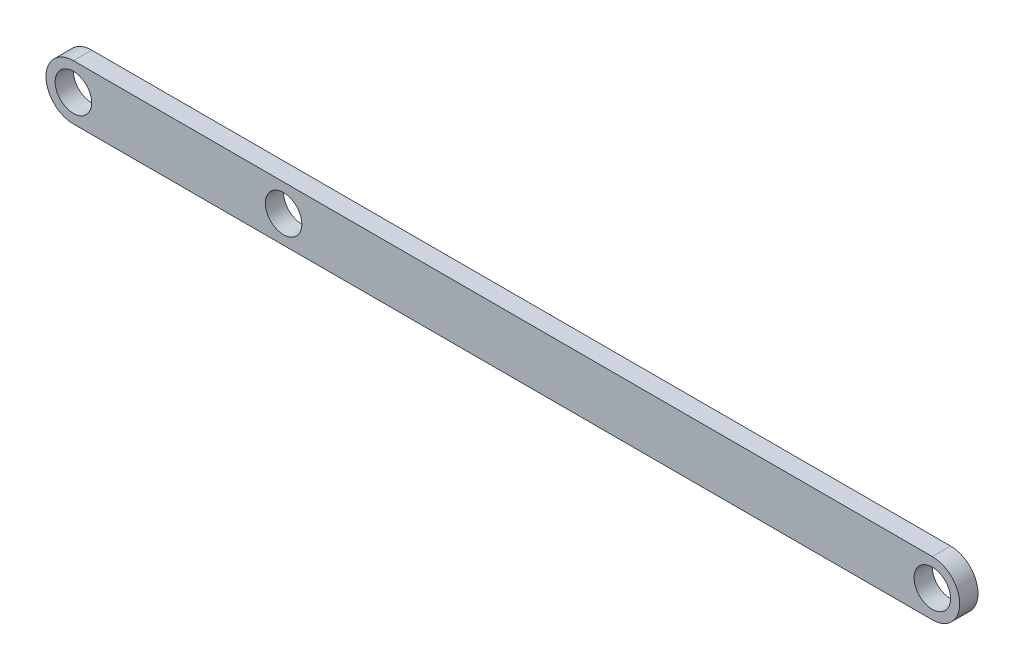
ISO-10303-21;
HEADER;
FILE_DESCRIPTION(('STEP AP214'),'2;1');
FILE_NAME('part.step','',(''),(''),'','','');
FILE_SCHEMA(('AUTOMOTIVE_DESIGN { 1 0 10303 214 1 1 1 1 }'));
ENDSEC;
DATA;
#1=APPLICATION_CONTEXT('core data for automotive mechanical design processes');
#2=APPLICATION_PROTOCOL_DEFINITION('international standard','automotive_design',2000,#1);
#3=PRODUCT_CONTEXT('',#1,'mechanical');
#4=PRODUCT('Part','Part','',(#3));
#5=PRODUCT_RELATED_PRODUCT_CATEGORY('part','',(#4));
#6=PRODUCT_DEFINITION_FORMATION('','',#4);
#7=PRODUCT_DEFINITION_CONTEXT('part definition',#1,'design');
#8=PRODUCT_DEFINITION('design','',#6,#7);
#9=PRODUCT_DEFINITION_SHAPE('','',#8);
#10=(LENGTH_UNIT() NAMED_UNIT(*) SI_UNIT(.MILLI.,.METRE.));
#11=(NAMED_UNIT(*) PLANE_ANGLE_UNIT() SI_UNIT($,.RADIAN.));
#12=(NAMED_UNIT(*) SI_UNIT($,.STERADIAN.) SOLID_ANGLE_UNIT());
#13=UNCERTAINTY_MEASURE_WITH_UNIT(LENGTH_MEASURE(1.E-05),#10,'distance_accuracy_value','');
#14=(GEOMETRIC_REPRESENTATION_CONTEXT(3) GLOBAL_UNCERTAINTY_ASSIGNED_CONTEXT((#13)) GLOBAL_UNIT_ASSIGNED_CONTEXT((#10,
#11,#12)) REPRESENTATION_CONTEXT('',''));
#15=CARTESIAN_POINT('',(0.,0.,0.));
#16=DIRECTION('',(0.,0.,1.));
#17=DIRECTION('',(1.,0.,0.));
#18=AXIS2_PLACEMENT_3D('',#15,#16,#17);
#19=CARTESIAN_POINT('',(0.,0.,5.));
#20=DIRECTION('',(0.,0.,-1.));
#21=DIRECTION('',(-1.,0.,0.));
#22=AXIS2_PLACEMENT_3D('',#19,#20,#21);
#23=PLANE('',#22);
#24=CARTESIAN_POINT('',(-185.,7.5,5.));
#25=DIRECTION('',(0.,0.,1.));
#26=DIRECTION('',(1.,0.,0.));
#27=AXIS2_PLACEMENT_3D('',#24,#25,#26);
#28=CIRCLE('',#27,4.99999999999999);
#29=CARTESIAN_POINT('',(-180.,7.5,5.));
#30=VERTEX_POINT('',#29);
#31=EDGE_CURVE('E174',#30,#30,#28,.T.);
#32=ORIENTED_EDGE('',*,*,#31,.F.);
#33=EDGE_LOOP('',(#32));
#34=FACE_BOUND('',#33,.T.);
#35=CARTESIAN_POINT('',(-242.5,7.5,5.));
#36=DIRECTION('',(0.,0.,1.));
#37=DIRECTION('',(1.,0.,0.));
#38=AXIS2_PLACEMENT_3D('',#35,#36,#37);
#39=CIRCLE('',#38,7.50000000000001);
#40=CARTESIAN_POINT('',(-242.5,15.,5.));
#41=VERTEX_POINT('',#40);
#42=CARTESIAN_POINT('',(-242.5,0.,5.));
#43=VERTEX_POINT('',#42);
#44=EDGE_CURVE('E107',#41,#43,#39,.T.);
#45=ORIENTED_EDGE('',*,*,#44,.T.);
#46=DIRECTION('',(1.,0.,0.));
#47=VECTOR('',#46,1.);
#48=CARTESIAN_POINT('',(-250.,0.,5.));
#49=LINE('',#48,#47);
#50=CARTESIAN_POINT('',(-7.50000000000001,0.,5.));
#51=VERTEX_POINT('',#50);
#52=EDGE_CURVE('E93',#43,#51,#49,.T.);
#53=ORIENTED_EDGE('',*,*,#52,.T.);
#54=CARTESIAN_POINT('',(-7.50000000000001,7.5,5.));
#55=DIRECTION('',(0.,0.,1.));
#56=DIRECTION('',(1.,0.,0.));
#57=AXIS2_PLACEMENT_3D('',#54,#55,#56);
#58=CIRCLE('',#57,7.50000000000001);
#59=CARTESIAN_POINT('',(-7.50000000000001,15.,5.));
#60=VERTEX_POINT('',#59);
#61=EDGE_CURVE('E133',#60,#51,#58,.F.);
#62=ORIENTED_EDGE('',*,*,#61,.F.);
#63=DIRECTION('',(-1.,0.,0.));
#64=VECTOR('',#63,1.);
#65=CARTESIAN_POINT('',(-250.,15.,5.));
#66=LINE('',#65,#64);
#67=EDGE_CURVE('E12',#60,#41,#66,.T.);
#68=ORIENTED_EDGE('',*,*,#67,.T.);
#69=EDGE_LOOP('',(#45,#53,#62,#68));
#70=FACE_BOUND('',#69,.T.);
#71=CARTESIAN_POINT('',(-7.50000000000001,7.5,5.));
#72=DIRECTION('',(0.,0.,1.));
#73=DIRECTION('',(1.,0.,0.));
#74=AXIS2_PLACEMENT_3D('',#71,#72,#73);
#75=CIRCLE('',#74,5.);
#76=CARTESIAN_POINT('',(-2.5,7.5,5.));
#77=VERTEX_POINT('',#76);
#78=EDGE_CURVE('E160',#77,#77,#75,.F.);
#79=ORIENTED_EDGE('',*,*,#78,.T.);
#80=EDGE_LOOP('',(#79));
#81=FACE_BOUND('',#80,.T.);
#82=CARTESIAN_POINT('',(-242.5,7.5,5.));
#83=DIRECTION('',(0.,0.,1.));
#84=DIRECTION('',(1.,0.,0.));
#85=AXIS2_PLACEMENT_3D('',#82,#83,#84);
#86=CIRCLE('',#85,4.99999999999999);
#87=CARTESIAN_POINT('',(-237.5,7.5,5.));
#88=VERTEX_POINT('',#87);
#89=EDGE_CURVE('E166',#88,#88,#86,.T.);
#90=ORIENTED_EDGE('',*,*,#89,.F.);
#91=EDGE_LOOP('',(#90));
#92=FACE_BOUND('',#91,.T.);
#93=ADVANCED_FACE('F84',(#34,#70,#81,#92),#23,.F.);
#94=CARTESIAN_POINT('',(0.,0.,0.));
#95=DIRECTION('',(0.,0.,-1.));
#96=DIRECTION('',(-1.,0.,0.));
#97=AXIS2_PLACEMENT_3D('',#94,#95,#96);
#98=PLANE('',#97);
#99=CARTESIAN_POINT('',(-185.,7.5,0.));
#100=DIRECTION('',(0.,0.,1.));
#101=DIRECTION('',(1.,0.,0.));
#102=AXIS2_PLACEMENT_3D('',#99,#100,#101);
#103=CIRCLE('',#102,4.99999999999999);
#104=CARTESIAN_POINT('',(-180.,7.5,0.));
#105=VERTEX_POINT('',#104);
#106=EDGE_CURVE('E147',#105,#105,#103,.T.);
#107=ORIENTED_EDGE('',*,*,#106,.T.);
#108=EDGE_LOOP('',(#107));
#109=FACE_BOUND('',#108,.T.);
#110=CARTESIAN_POINT('',(-7.50000000000001,7.5,0.));
#111=DIRECTION('',(0.,0.,1.));
#112=DIRECTION('',(1.,0.,0.));
#113=AXIS2_PLACEMENT_3D('',#110,#111,#112);
#114=CIRCLE('',#113,5.);
#115=CARTESIAN_POINT('',(-2.5,7.5,0.));
#116=VERTEX_POINT('',#115);
#117=EDGE_CURVE('E141',#116,#116,#114,.F.);
#118=ORIENTED_EDGE('',*,*,#117,.F.);
#119=EDGE_LOOP('',(#118));
#120=FACE_BOUND('',#119,.T.);
#121=DIRECTION('',(1.,0.,0.));
#122=VECTOR('',#121,1.);
#123=CARTESIAN_POINT('',(-250.,0.,0.));
#124=LINE('',#123,#122);
#125=CARTESIAN_POINT('',(-242.5,0.,0.));
#126=VERTEX_POINT('',#125);
#127=CARTESIAN_POINT('',(-7.50000000000001,0.,0.));
#128=VERTEX_POINT('',#127);
#129=EDGE_CURVE('E145',#126,#128,#124,.T.);
#130=ORIENTED_EDGE('',*,*,#129,.F.);
#131=CARTESIAN_POINT('',(-242.5,7.5,0.));
#132=DIRECTION('',(0.,0.,1.));
#133=DIRECTION('',(1.,0.,0.));
#134=AXIS2_PLACEMENT_3D('',#131,#132,#133);
#135=CIRCLE('',#134,7.50000000000001);
#136=CARTESIAN_POINT('',(-242.5,15.,0.));
#137=VERTEX_POINT('',#136);
#138=EDGE_CURVE('E123',#137,#126,#135,.T.);
#139=ORIENTED_EDGE('',*,*,#138,.F.);
#140=DIRECTION('',(-1.,0.,0.));
#141=VECTOR('',#140,1.);
#142=CARTESIAN_POINT('',(-250.,15.,0.));
#143=LINE('',#142,#141);
#144=CARTESIAN_POINT('',(-7.50000000000001,15.,0.));
#145=VERTEX_POINT('',#144);
#146=EDGE_CURVE('E88',#145,#137,#143,.T.);
#147=ORIENTED_EDGE('',*,*,#146,.F.);
#148=CARTESIAN_POINT('',(-7.50000000000001,7.5,0.));
#149=DIRECTION('',(0.,0.,1.));
#150=DIRECTION('',(1.,0.,0.));
#151=AXIS2_PLACEMENT_3D('',#148,#149,#150);
#152=CIRCLE('',#151,7.50000000000001);
#153=EDGE_CURVE('E131',#145,#128,#152,.F.);
#154=ORIENTED_EDGE('',*,*,#153,.T.);
#155=EDGE_LOOP('',(#130,#139,#147,#154));
#156=FACE_BOUND('',#155,.T.);
#157=CARTESIAN_POINT('',(-242.5,7.5,0.));
#158=DIRECTION('',(0.,0.,1.));
#159=DIRECTION('',(1.,0.,0.));
#160=AXIS2_PLACEMENT_3D('',#157,#158,#159);
#161=CIRCLE('',#160,4.99999999999999);
#162=CARTESIAN_POINT('',(-237.5,7.5,0.));
#163=VERTEX_POINT('',#162);
#164=EDGE_CURVE('E163',#163,#163,#161,.T.);
#165=ORIENTED_EDGE('',*,*,#164,.T.);
#166=EDGE_LOOP('',(#165));
#167=FACE_BOUND('',#166,.T.);
#168=ADVANCED_FACE('F180',(#109,#120,#156,#167),#98,.T.);
#169=CARTESIAN_POINT('',(-250.,0.,5.));
#170=DIRECTION('',(0.,1.,0.));
#171=DIRECTION('',(0.,0.,1.));
#172=AXIS2_PLACEMENT_3D('',#169,#170,#171);
#173=PLANE('',#172);
#174=DIRECTION('',(0.,0.,1.));
#175=VECTOR('',#174,1.);
#176=CARTESIAN_POINT('',(-242.5,0.,0.));
#177=LINE('',#176,#175);
#178=EDGE_CURVE('E146',#126,#43,#177,.T.);
#179=ORIENTED_EDGE('',*,*,#178,.F.);
#180=ORIENTED_EDGE('',*,*,#129,.T.);
#181=DIRECTION('',(0.,0.,1.));
#182=VECTOR('',#181,1.);
#183=CARTESIAN_POINT('',(-7.50000000000001,0.,0.));
#184=LINE('',#183,#182);
#185=EDGE_CURVE('E136',#128,#51,#184,.T.);
#186=ORIENTED_EDGE('',*,*,#185,.T.);
#187=ORIENTED_EDGE('',*,*,#52,.F.);
#188=EDGE_LOOP('',(#179,#180,#186,#187));
#189=FACE_BOUND('',#188,.T.);
#190=ADVANCED_FACE('F86',(#189),#173,.F.);
#191=CARTESIAN_POINT('',(-250.,15.,5.));
#192=DIRECTION('',(0.,-1.,0.));
#193=DIRECTION('',(1.,0.,0.));
#194=AXIS2_PLACEMENT_3D('',#191,#192,#193);
#195=PLANE('',#194);
#196=ORIENTED_EDGE('',*,*,#146,.T.);
#197=DIRECTION('',(0.,0.,1.));
#198=VECTOR('',#197,1.);
#199=CARTESIAN_POINT('',(-242.5,15.,0.));
#200=LINE('',#199,#198);
#201=EDGE_CURVE('E101',#137,#41,#200,.T.);
#202=ORIENTED_EDGE('',*,*,#201,.T.);
#203=ORIENTED_EDGE('',*,*,#67,.F.);
#204=DIRECTION('',(0.,0.,1.));
#205=VECTOR('',#204,1.);
#206=CARTESIAN_POINT('',(-7.50000000000001,15.,0.));
#207=LINE('',#206,#205);
#208=EDGE_CURVE('E119',#145,#60,#207,.T.);
#209=ORIENTED_EDGE('',*,*,#208,.F.);
#210=EDGE_LOOP('',(#196,#202,#203,#209));
#211=FACE_BOUND('',#210,.T.);
#212=ADVANCED_FACE('F198',(#211),#195,.F.);
#213=CARTESIAN_POINT('',(-7.50000000000001,7.5,0.));
#214=DIRECTION('',(0.,0.,1.));
#215=DIRECTION('',(1.,0.,0.));
#216=AXIS2_PLACEMENT_3D('',#213,#214,#215);
#217=CYLINDRICAL_SURFACE('',#216,7.50000000000001);
#218=ORIENTED_EDGE('',*,*,#61,.T.);
#219=ORIENTED_EDGE('',*,*,#185,.F.);
#220=ORIENTED_EDGE('',*,*,#153,.F.);
#221=ORIENTED_EDGE('',*,*,#208,.T.);
#222=EDGE_LOOP('',(#218,#219,#220,#221));
#223=FACE_BOUND('',#222,.T.);
#224=ADVANCED_FACE('F135',(#223),#217,.T.);
#225=CARTESIAN_POINT('',(-7.50000000000001,7.5,0.));
#226=DIRECTION('',(0.,0.,1.));
#227=DIRECTION('',(1.,0.,0.));
#228=AXIS2_PLACEMENT_3D('',#225,#226,#227);
#229=CYLINDRICAL_SURFACE('',#228,5.);
#230=ORIENTED_EDGE('',*,*,#117,.T.);
#231=EDGE_LOOP('',(#230));
#232=FACE_BOUND('',#231,.T.);
#233=ORIENTED_EDGE('',*,*,#78,.F.);
#234=EDGE_LOOP('',(#233));
#235=FACE_BOUND('',#234,.T.);
#236=ADVANCED_FACE('F204',(#232,#235),#229,.F.);
#237=CARTESIAN_POINT('',(-242.5,7.5,0.));
#238=DIRECTION('',(0.,0.,1.));
#239=DIRECTION('',(1.,0.,0.));
#240=AXIS2_PLACEMENT_3D('',#237,#238,#239);
#241=CYLINDRICAL_SURFACE('',#240,7.50000000000001);
#242=ORIENTED_EDGE('',*,*,#44,.F.);
#243=ORIENTED_EDGE('',*,*,#201,.F.);
#244=ORIENTED_EDGE('',*,*,#138,.T.);
#245=ORIENTED_EDGE('',*,*,#178,.T.);
#246=EDGE_LOOP('',(#242,#243,#244,#245));
#247=FACE_BOUND('',#246,.T.);
#248=ADVANCED_FACE('F228',(#247),#241,.T.);
#249=CARTESIAN_POINT('',(-242.5,7.5,0.));
#250=DIRECTION('',(0.,0.,1.));
#251=DIRECTION('',(1.,0.,0.));
#252=AXIS2_PLACEMENT_3D('',#249,#250,#251);
#253=CYLINDRICAL_SURFACE('',#252,4.99999999999999);
#254=ORIENTED_EDGE('',*,*,#164,.F.);
#255=EDGE_LOOP('',(#254));
#256=FACE_BOUND('',#255,.T.);
#257=ORIENTED_EDGE('',*,*,#89,.T.);
#258=EDGE_LOOP('',(#257));
#259=FACE_BOUND('',#258,.T.);
#260=ADVANCED_FACE('F186',(#256,#259),#253,.F.);
#261=CARTESIAN_POINT('',(-185.,7.5,0.));
#262=DIRECTION('',(0.,0.,1.));
#263=DIRECTION('',(1.,0.,0.));
#264=AXIS2_PLACEMENT_3D('',#261,#262,#263);
#265=CYLINDRICAL_SURFACE('',#264,4.99999999999999);
#266=ORIENTED_EDGE('',*,*,#106,.F.);
#267=EDGE_LOOP('',(#266));
#268=FACE_BOUND('',#267,.T.);
#269=ORIENTED_EDGE('',*,*,#31,.T.);
#270=EDGE_LOOP('',(#269));
#271=FACE_BOUND('',#270,.T.);
#272=ADVANCED_FACE('F183',(#268,#271),#265,.F.);
#273=CLOSED_SHELL('',(#93,#168,#190,#212,#224,#236,#248,#260,#272));
#274=MANIFOLD_SOLID_BREP('B2',#273);
#275=ADVANCED_BREP_SHAPE_REPRESENTATION('',(#18,#274),#14);
#276=SHAPE_DEFINITION_REPRESENTATION(#9,#275);
ENDSEC;
END-ISO-10303-21;
